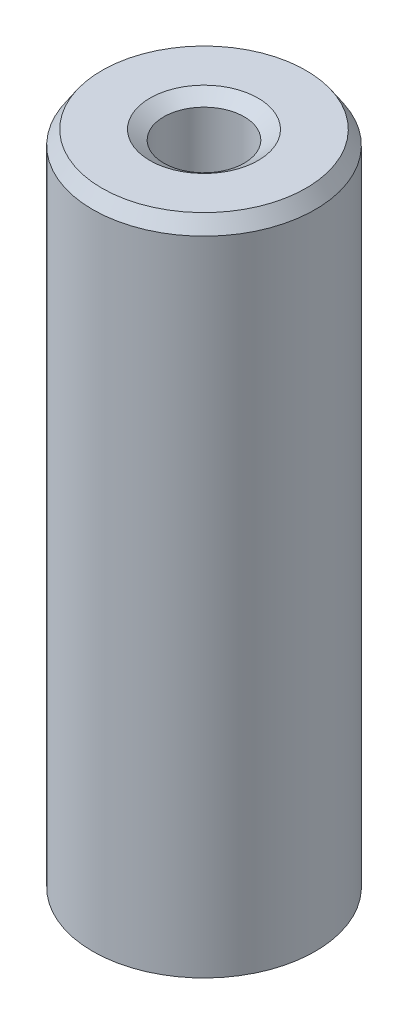
ISO-10303-21;
HEADER;
FILE_DESCRIPTION(('STEP AP214'),'2;1');
FILE_NAME('part.step','',(''),(''),'','','');
FILE_SCHEMA(('AUTOMOTIVE_DESIGN { 1 0 10303 214 1 1 1 1 }'));
ENDSEC;
DATA;
#1=APPLICATION_CONTEXT('core data for automotive mechanical design processes');
#2=APPLICATION_PROTOCOL_DEFINITION('international standard','automotive_design',2000,#1);
#3=PRODUCT_CONTEXT('',#1,'mechanical');
#4=PRODUCT('Part','Part','',(#3));
#5=PRODUCT_RELATED_PRODUCT_CATEGORY('part','',(#4));
#6=PRODUCT_DEFINITION_FORMATION('','',#4);
#7=PRODUCT_DEFINITION_CONTEXT('part definition',#1,'design');
#8=PRODUCT_DEFINITION('design','',#6,#7);
#9=PRODUCT_DEFINITION_SHAPE('','',#8);
#10=(LENGTH_UNIT() NAMED_UNIT(*) SI_UNIT(.MILLI.,.METRE.));
#11=(NAMED_UNIT(*) PLANE_ANGLE_UNIT() SI_UNIT($,.RADIAN.));
#12=(NAMED_UNIT(*) SI_UNIT($,.STERADIAN.) SOLID_ANGLE_UNIT());
#13=UNCERTAINTY_MEASURE_WITH_UNIT(LENGTH_MEASURE(1.E-05),#10,'distance_accuracy_value','');
#14=(GEOMETRIC_REPRESENTATION_CONTEXT(3) GLOBAL_UNCERTAINTY_ASSIGNED_CONTEXT((#13)) GLOBAL_UNIT_ASSIGNED_CONTEXT((#10,
#11,#12)) REPRESENTATION_CONTEXT('',''));
#15=CARTESIAN_POINT('',(0.,0.,0.));
#16=DIRECTION('',(0.,0.,1.));
#17=DIRECTION('',(1.,0.,0.));
#18=AXIS2_PLACEMENT_3D('',#15,#16,#17);
#19=CARTESIAN_POINT('',(0.,29.9058538316299,0.));
#20=DIRECTION('',(0.,-1.,0.));
#21=DIRECTION('',(0.,0.,-1.));
#22=AXIS2_PLACEMENT_3D('',#19,#20,#21);
#23=CYLINDRICAL_SURFACE('',#22,5.);
#24=CARTESIAN_POINT('',(0.,0.414501485925253,0.));
#25=DIRECTION('',(0.,1.,0.));
#26=DIRECTION('',(0.,0.,1.));
#27=AXIS2_PLACEMENT_3D('',#24,#25,#26);
#28=CIRCLE('',#27,5.);
#29=CARTESIAN_POINT('',(0.,0.414501485925253,5.));
#30=VERTEX_POINT('',#29);
#31=EDGE_CURVE('E10',#30,#30,#28,.T.);
#32=ORIENTED_EDGE('',*,*,#31,.T.);
#33=EDGE_LOOP('',(#32));
#34=FACE_BOUND('',#33,.T.);
#35=CARTESIAN_POINT('',(0.,29.2814522791768,0.));
#36=DIRECTION('',(0.,1.,0.));
#37=DIRECTION('',(0.,0.,1.));
#38=AXIS2_PLACEMENT_3D('',#35,#36,#37);
#39=CIRCLE('',#38,5.);
#40=CARTESIAN_POINT('',(0.,29.2814522791768,5.));
#41=VERTEX_POINT('',#40);
#42=EDGE_CURVE('E50',#41,#41,#39,.F.);
#43=ORIENTED_EDGE('',*,*,#42,.T.);
#44=EDGE_LOOP('',(#43));
#45=FACE_BOUND('',#44,.T.);
#46=ADVANCED_FACE('F39',(#34,#45),#23,.T.);
#47=CARTESIAN_POINT('',(0.,29.9058538316299,0.));
#48=DIRECTION('',(0.,1.,0.));
#49=DIRECTION('',(0.,0.,1.));
#50=AXIS2_PLACEMENT_3D('',#47,#48,#49);
#51=PLANE('',#50);
#52=CARTESIAN_POINT('',(0.,29.9058538316299,0.));
#53=DIRECTION('',(0.,1.,0.));
#54=DIRECTION('',(0.,0.,1.));
#55=AXIS2_PLACEMENT_3D('',#52,#53,#54);
#56=CIRCLE('',#55,2.43137785275572);
#57=CARTESIAN_POINT('',(0.,29.9058538316299,2.43137785275572));
#58=VERTEX_POINT('',#57);
#59=EDGE_CURVE('E58',#58,#58,#56,.F.);
#60=ORIENTED_EDGE('',*,*,#59,.T.);
#61=EDGE_LOOP('',(#60));
#62=FACE_BOUND('',#61,.T.);
#63=CARTESIAN_POINT('',(0.,29.9058538316299,0.));
#64=DIRECTION('',(0.,1.,0.));
#65=DIRECTION('',(0.,0.,1.));
#66=AXIS2_PLACEMENT_3D('',#63,#64,#65);
#67=CIRCLE('',#66,4.58549851407476);
#68=CARTESIAN_POINT('',(0.,29.9058538316299,4.58549851407476));
#69=VERTEX_POINT('',#68);
#70=EDGE_CURVE('E61',#69,#69,#67,.T.);
#71=ORIENTED_EDGE('',*,*,#70,.T.);
#72=EDGE_LOOP('',(#71));
#73=FACE_BOUND('',#72,.T.);
#74=ADVANCED_FACE('F88',(#62,#73),#51,.T.);
#75=CARTESIAN_POINT('',(0.,0.,0.));
#76=DIRECTION('',(0.,1.,0.));
#77=DIRECTION('',(0.,0.,1.));
#78=AXIS2_PLACEMENT_3D('',#75,#76,#77);
#79=PLANE('',#78);
#80=CARTESIAN_POINT('',(0.,0.,0.));
#81=DIRECTION('',(0.,1.,0.));
#82=DIRECTION('',(0.,0.,1.));
#83=AXIS2_PLACEMENT_3D('',#80,#81,#82);
#84=CIRCLE('',#83,2.22147778622788);
#85=CARTESIAN_POINT('',(0.,0.,2.22147778622788));
#86=VERTEX_POINT('',#85);
#87=EDGE_CURVE('E51',#86,#86,#84,.T.);
#88=ORIENTED_EDGE('',*,*,#87,.T.);
#89=EDGE_LOOP('',(#88));
#90=FACE_BOUND('',#89,.T.);
#91=CARTESIAN_POINT('',(0.,0.,0.));
#92=DIRECTION('',(0.,1.,0.));
#93=DIRECTION('',(0.,0.,1.));
#94=AXIS2_PLACEMENT_3D('',#91,#92,#93);
#95=CIRCLE('',#94,4.37559844754691);
#96=CARTESIAN_POINT('',(0.,0.,4.37559844754691));
#97=VERTEX_POINT('',#96);
#98=EDGE_CURVE('E54',#97,#97,#95,.F.);
#99=ORIENTED_EDGE('',*,*,#98,.T.);
#100=EDGE_LOOP('',(#99));
#101=FACE_BOUND('',#100,.T.);
#102=ADVANCED_FACE('F83',(#90,#101),#79,.F.);
#103=CARTESIAN_POINT('',(0.,29.9058538316299,0.));
#104=DIRECTION('',(0.,-1.,0.));
#105=DIRECTION('',(0.,0.,-1.));
#106=AXIS2_PLACEMENT_3D('',#103,#104,#105);
#107=CYLINDRICAL_SURFACE('',#106,1.80697630030263);
#108=CARTESIAN_POINT('',(0.,29.4913523457046,0.));
#109=DIRECTION('',(0.,1.,0.));
#110=DIRECTION('',(0.,0.,1.));
#111=AXIS2_PLACEMENT_3D('',#108,#109,#110);
#112=CIRCLE('',#111,1.80697630030263);
#113=CARTESIAN_POINT('',(0.,29.4913523457046,1.80697630030263));
#114=VERTEX_POINT('',#113);
#115=EDGE_CURVE('E67',#114,#114,#112,.T.);
#116=ORIENTED_EDGE('',*,*,#115,.T.);
#117=EDGE_LOOP('',(#116));
#118=FACE_BOUND('',#117,.T.);
#119=CARTESIAN_POINT('',(0.,0.62440155245308,0.));
#120=DIRECTION('',(0.,1.,0.));
#121=DIRECTION('',(0.,0.,1.));
#122=AXIS2_PLACEMENT_3D('',#119,#120,#121);
#123=CIRCLE('',#122,1.80697630030263);
#124=CARTESIAN_POINT('',(0.,0.62440155245308,1.80697630030263));
#125=VERTEX_POINT('',#124);
#126=EDGE_CURVE('E69',#125,#125,#123,.F.);
#127=ORIENTED_EDGE('',*,*,#126,.T.);
#128=EDGE_LOOP('',(#127));
#129=FACE_BOUND('',#128,.T.);
#130=ADVANCED_FACE('F71',(#118,#129),#107,.F.);
#131=CARTESIAN_POINT('',(0.,29.4913523457046,0.));
#132=DIRECTION('',(0.,1.,0.));
#133=DIRECTION('',(0.,0.,1.));
#134=AXIS2_PLACEMENT_3D('',#131,#132,#133);
#135=CONICAL_SURFACE('',#134,1.80697630030263,0.984754579357019);
#136=ORIENTED_EDGE('',*,*,#59,.F.);
#137=EDGE_LOOP('',(#136));
#138=FACE_BOUND('',#137,.T.);
#139=ORIENTED_EDGE('',*,*,#115,.F.);
#140=EDGE_LOOP('',(#139));
#141=FACE_BOUND('',#140,.T.);
#142=ADVANCED_FACE('F77',(#138,#141),#135,.F.);
#143=CARTESIAN_POINT('',(0.,0.,0.));
#144=DIRECTION('',(0.,-1.,0.));
#145=DIRECTION('',(0.,0.,-1.));
#146=AXIS2_PLACEMENT_3D('',#143,#144,#145);
#147=CONICAL_SURFACE('',#146,2.22147778622788,0.586041747437874);
#148=ORIENTED_EDGE('',*,*,#126,.F.);
#149=EDGE_LOOP('',(#148));
#150=FACE_BOUND('',#149,.T.);
#151=ORIENTED_EDGE('',*,*,#87,.F.);
#152=EDGE_LOOP('',(#151));
#153=FACE_BOUND('',#152,.T.);
#154=ADVANCED_FACE('F73',(#150,#153),#147,.F.);
#155=CARTESIAN_POINT('',(0.,0.414501485925253,0.));
#156=DIRECTION('',(0.,1.,0.));
#157=DIRECTION('',(0.,0.,1.));
#158=AXIS2_PLACEMENT_3D('',#155,#156,#157);
#159=CONICAL_SURFACE('',#158,5.,0.98475457935702);
#160=ORIENTED_EDGE('',*,*,#98,.F.);
#161=EDGE_LOOP('',(#160));
#162=FACE_BOUND('',#161,.T.);
#163=ORIENTED_EDGE('',*,*,#31,.F.);
#164=EDGE_LOOP('',(#163));
#165=FACE_BOUND('',#164,.T.);
#166=ADVANCED_FACE('F76',(#162,#165),#159,.T.);
#167=CARTESIAN_POINT('',(0.,29.9058538316299,0.));
#168=DIRECTION('',(0.,-1.,0.));
#169=DIRECTION('',(0.,0.,-1.));
#170=AXIS2_PLACEMENT_3D('',#167,#168,#169);
#171=CONICAL_SURFACE('',#170,4.58549851407476,0.586041747437877);
#172=ORIENTED_EDGE('',*,*,#42,.F.);
#173=EDGE_LOOP('',(#172));
#174=FACE_BOUND('',#173,.T.);
#175=ORIENTED_EDGE('',*,*,#70,.F.);
#176=EDGE_LOOP('',(#175));
#177=FACE_BOUND('',#176,.T.);
#178=ADVANCED_FACE('F45',(#174,#177),#171,.T.);
#179=CLOSED_SHELL('',(#46,#74,#102,#130,#142,#154,#166,#178));
#180=MANIFOLD_SOLID_BREP('B2',#179);
#181=ADVANCED_BREP_SHAPE_REPRESENTATION('',(#18,#180),#14);
#182=SHAPE_DEFINITION_REPRESENTATION(#9,#181);
ENDSEC;
END-ISO-10303-21;
